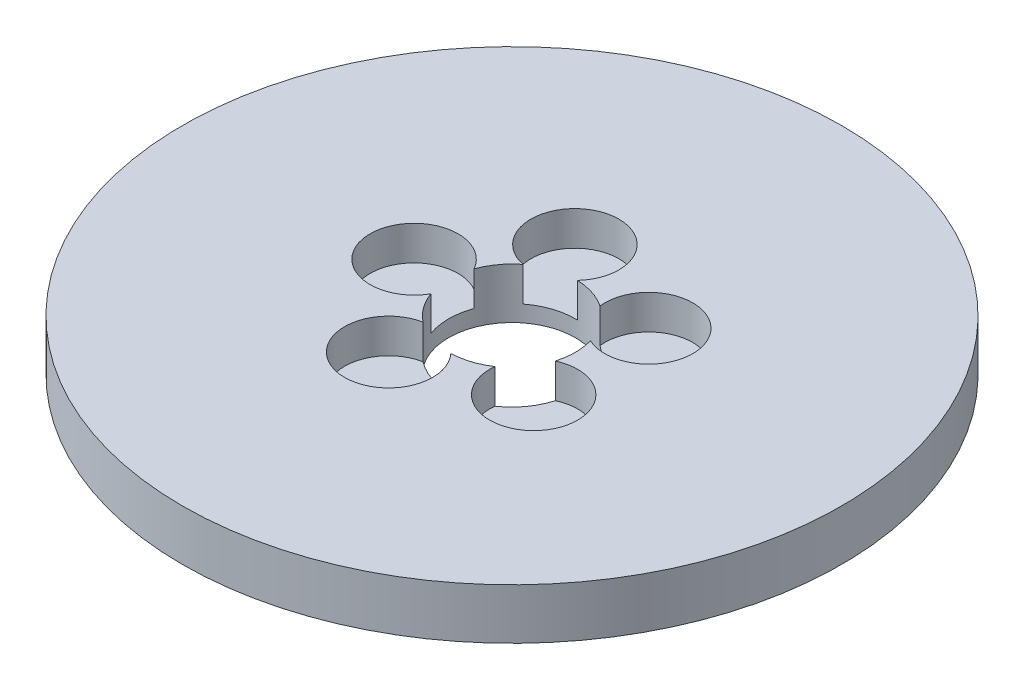
ISO-10303-21;
HEADER;
FILE_DESCRIPTION(('STEP AP214'),'2;1');
FILE_NAME('part.step','',(''),(''),'','','');
FILE_SCHEMA(('AUTOMOTIVE_DESIGN { 1 0 10303 214 1 1 1 1 }'));
ENDSEC;
DATA;
#1=APPLICATION_CONTEXT('core data for automotive mechanical design processes');
#2=APPLICATION_PROTOCOL_DEFINITION('international standard','automotive_design',2000,#1);
#3=PRODUCT_CONTEXT('',#1,'mechanical');
#4=PRODUCT('Part','Part','',(#3));
#5=PRODUCT_RELATED_PRODUCT_CATEGORY('part','',(#4));
#6=PRODUCT_DEFINITION_FORMATION('','',#4);
#7=PRODUCT_DEFINITION_CONTEXT('part definition',#1,'design');
#8=PRODUCT_DEFINITION('design','',#6,#7);
#9=PRODUCT_DEFINITION_SHAPE('','',#8);
#10=(LENGTH_UNIT() NAMED_UNIT(*) SI_UNIT(.MILLI.,.METRE.));
#11=(NAMED_UNIT(*) PLANE_ANGLE_UNIT() SI_UNIT($,.RADIAN.));
#12=(NAMED_UNIT(*) SI_UNIT($,.STERADIAN.) SOLID_ANGLE_UNIT());
#13=UNCERTAINTY_MEASURE_WITH_UNIT(LENGTH_MEASURE(1.E-05),#10,'distance_accuracy_value','');
#14=(GEOMETRIC_REPRESENTATION_CONTEXT(3) GLOBAL_UNCERTAINTY_ASSIGNED_CONTEXT((#13)) GLOBAL_UNIT_ASSIGNED_CONTEXT((#10,
#11,#12)) REPRESENTATION_CONTEXT('',''));
#15=CARTESIAN_POINT('',(0.,0.,0.));
#16=DIRECTION('',(0.,0.,1.));
#17=DIRECTION('',(1.,0.,0.));
#18=AXIS2_PLACEMENT_3D('',#15,#16,#17);
#19=CARTESIAN_POINT('',(0.,10.,0.));
#20=DIRECTION('',(0.,-1.,0.));
#21=DIRECTION('',(0.,0.,-1.));
#22=AXIS2_PLACEMENT_3D('',#19,#20,#21);
#23=CYLINDRICAL_SURFACE('',#22,65.);
#24=CARTESIAN_POINT('',(0.,10.,0.));
#25=DIRECTION('',(0.,1.,0.));
#26=DIRECTION('',(0.,0.,1.));
#27=AXIS2_PLACEMENT_3D('',#24,#25,#26);
#28=CIRCLE('',#27,65.);
#29=CARTESIAN_POINT('',(0.,10.,65.));
#30=VERTEX_POINT('',#29);
#31=EDGE_CURVE('E157',#30,#30,#28,.T.);
#32=ORIENTED_EDGE('',*,*,#31,.F.);
#33=EDGE_LOOP('',(#32));
#34=FACE_BOUND('',#33,.T.);
#35=CARTESIAN_POINT('',(0.,0.,0.));
#36=DIRECTION('',(0.,1.,0.));
#37=DIRECTION('',(0.,0.,1.));
#38=AXIS2_PLACEMENT_3D('',#35,#36,#37);
#39=CIRCLE('',#38,65.);
#40=CARTESIAN_POINT('',(0.,0.,65.));
#41=VERTEX_POINT('',#40);
#42=EDGE_CURVE('E150',#41,#41,#39,.T.);
#43=ORIENTED_EDGE('',*,*,#42,.T.);
#44=EDGE_LOOP('',(#43));
#45=FACE_BOUND('',#44,.T.);
#46=ADVANCED_FACE('F39',(#34,#45),#23,.T.);
#47=CARTESIAN_POINT('',(0.,10.,0.));
#48=DIRECTION('',(0.,1.,0.));
#49=DIRECTION('',(0.,0.,1.));
#50=AXIS2_PLACEMENT_3D('',#47,#48,#49);
#51=PLANE('',#50);
#52=CARTESIAN_POINT('',(-5.96773820092285,10.,-18.3668096151514));
#53=DIRECTION('',(0.,1.,0.));
#54=DIRECTION('',(-0.95105651629515,0.,0.309016994374958));
#55=AXIS2_PLACEMENT_3D('',#52,#53,#54);
#56=CIRCLE('',#55,8.68334895142831);
#57=CARTESIAN_POINT('',(0.427209526184432,10.,-12.4926975477972));
#58=VERTEX_POINT('',#57);
#59=CARTESIAN_POINT('',(-7.68864314678781,10.,-9.8556971626239));
#60=VERTEX_POINT('',#59);
#61=EDGE_CURVE('E194',#58,#60,#56,.T.);
#62=ORIENTED_EDGE('',*,*,#61,.F.);
#63=CARTESIAN_POINT('',(0.,10.,0.));
#64=DIRECTION('',(0.,1.,0.));
#65=DIRECTION('',(0.,0.,1.));
#66=AXIS2_PLACEMENT_3D('',#63,#64,#65);
#67=CIRCLE('',#66,12.5);
#68=CARTESIAN_POINT('',(6.99740361310323,10.,-10.3579120808843));
#69=VERTEX_POINT('',#68);
#70=EDGE_CURVE('E147',#69,#58,#67,.T.);
#71=ORIENTED_EDGE('',*,*,#70,.F.);
#72=CARTESIAN_POINT('',(15.6237414459765,10.,-11.3513126070621));
#73=DIRECTION('',(0.,1.,0.));
#74=DIRECTION('',(-0.58778525229248,0.,-0.809016994374942));
#75=AXIS2_PLACEMENT_3D('',#72,#73,#74);
#76=CIRCLE('',#75,8.68334895142831);
#77=CARTESIAN_POINT('',(12.0132764126868,10.,-3.45415544415446));
#78=VERTEX_POINT('',#77);
#79=EDGE_CURVE('E254',#78,#69,#76,.T.);
#80=ORIENTED_EDGE('',*,*,#79,.F.);
#81=CARTESIAN_POINT('',(12.0132764126869,10.,3.45415544415428));
#82=VERTEX_POINT('',#81);
#83=EDGE_CURVE('E144',#82,#78,#67,.T.);
#84=ORIENTED_EDGE('',*,*,#83,.F.);
#85=CARTESIAN_POINT('',(15.6237414459767,10.,11.3513126070619));
#86=DIRECTION('',(0.,1.,0.));
#87=DIRECTION('',(0.587785252292469,0.,-0.809016994374951));
#88=AXIS2_PLACEMENT_3D('',#85,#86,#87);
#89=CIRCLE('',#88,8.68334895142831);
#90=CARTESIAN_POINT('',(6.99740361310339,10.,10.3579120808842));
#91=VERTEX_POINT('',#90);
#92=EDGE_CURVE('E141',#91,#82,#89,.T.);
#93=ORIENTED_EDGE('',*,*,#92,.F.);
#94=CARTESIAN_POINT('',(0.427209526184603,10.,12.4926975477972));
#95=VERTEX_POINT('',#94);
#96=EDGE_CURVE('E134',#95,#91,#67,.T.);
#97=ORIENTED_EDGE('',*,*,#96,.F.);
#98=CARTESIAN_POINT('',(-5.96773820092259,10.,18.3668096151515));
#99=DIRECTION('',(0.,1.,0.));
#100=DIRECTION('',(0.951056516295155,0.,0.309016994374945));
#101=AXIS2_PLACEMENT_3D('',#98,#99,#100);
#102=CIRCLE('',#101,8.68334895142831);
#103=CARTESIAN_POINT('',(-7.68864314678767,10.,9.85569716262401));
#104=VERTEX_POINT('',#103);
#105=EDGE_CURVE('E111',#104,#95,#102,.T.);
#106=ORIENTED_EDGE('',*,*,#105,.F.);
#107=CARTESIAN_POINT('',(-11.7492464051871,10.,4.26675625155676));
#108=VERTEX_POINT('',#107);
#109=EDGE_CURVE('E145',#108,#104,#67,.T.);
#110=ORIENTED_EDGE('',*,*,#109,.F.);
#111=CARTESIAN_POINT('',(-19.312006490108,10.,0.));
#112=DIRECTION('',(0.,1.,0.));
#113=DIRECTION('',(0.,0.,1.));
#114=AXIS2_PLACEMENT_3D('',#111,#112,#113);
#115=CIRCLE('',#114,8.68334895142831);
#116=CARTESIAN_POINT('',(-11.7492464051871,10.,-4.26675625155676));
#117=VERTEX_POINT('',#116);
#118=EDGE_CURVE('E153',#117,#108,#115,.T.);
#119=ORIENTED_EDGE('',*,*,#118,.F.);
#120=EDGE_CURVE('E146',#60,#117,#67,.T.);
#121=ORIENTED_EDGE('',*,*,#120,.F.);
#122=EDGE_LOOP('',(#62,#71,#80,#84,#93,#97,#106,#110,#119,#121));
#123=FACE_BOUND('',#122,.T.);
#124=ORIENTED_EDGE('',*,*,#31,.T.);
#125=EDGE_LOOP('',(#124));
#126=FACE_BOUND('',#125,.T.);
#127=ADVANCED_FACE('F139',(#123,#126),#51,.T.);
#128=CARTESIAN_POINT('',(0.,0.,0.));
#129=DIRECTION('',(0.,1.,0.));
#130=DIRECTION('',(0.,0.,1.));
#131=AXIS2_PLACEMENT_3D('',#128,#129,#130);
#132=PLANE('',#131);
#133=CARTESIAN_POINT('',(0.,0.,0.));
#134=DIRECTION('',(0.,1.,0.));
#135=DIRECTION('',(0.,0.,1.));
#136=AXIS2_PLACEMENT_3D('',#133,#134,#135);
#137=CIRCLE('',#136,12.5);
#138=CARTESIAN_POINT('',(0.,0.,12.5));
#139=VERTEX_POINT('',#138);
#140=EDGE_CURVE('E154',#139,#139,#137,.T.);
#141=ORIENTED_EDGE('',*,*,#140,.T.);
#142=EDGE_LOOP('',(#141));
#143=FACE_BOUND('',#142,.T.);
#144=ORIENTED_EDGE('',*,*,#42,.F.);
#145=EDGE_LOOP('',(#144));
#146=FACE_BOUND('',#145,.T.);
#147=ADVANCED_FACE('F213',(#143,#146),#132,.F.);
#148=CARTESIAN_POINT('',(0.,10.,0.));
#149=DIRECTION('',(0.,-1.,0.));
#150=DIRECTION('',(0.,0.,-1.));
#151=AXIS2_PLACEMENT_3D('',#148,#149,#150);
#152=CYLINDRICAL_SURFACE('',#151,12.5);
#153=DIRECTION('',(0.,1.,0.));
#154=VECTOR('',#153,1.);
#155=CARTESIAN_POINT('',(0.427209526184431,6.61251886122305,-12.4926975477972));
#156=LINE('',#155,#154);
#157=CARTESIAN_POINT('',(0.427209526184432,3.22503772244611,-12.4926975477972));
#158=VERTEX_POINT('',#157);
#159=EDGE_CURVE('E11',#158,#58,#156,.T.);
#160=ORIENTED_EDGE('',*,*,#159,.F.);
#161=CARTESIAN_POINT('',(0.,3.22503772244611,0.));
#162=DIRECTION('',(0.,1.,0.));
#163=DIRECTION('',(0.,0.,1.));
#164=AXIS2_PLACEMENT_3D('',#161,#162,#163);
#165=CIRCLE('',#164,12.5);
#166=CARTESIAN_POINT('',(-7.68864314678781,3.22503772244611,-9.8556971626239));
#167=VERTEX_POINT('',#166);
#168=EDGE_CURVE('E189',#158,#167,#165,.T.);
#169=ORIENTED_EDGE('',*,*,#168,.T.);
#170=DIRECTION('',(0.,1.,0.));
#171=VECTOR('',#170,1.);
#172=CARTESIAN_POINT('',(-7.68864314678782,6.61251886122305,-9.8556971626239));
#173=LINE('',#172,#171);
#174=EDGE_CURVE('E46',#60,#167,#173,.F.);
#175=ORIENTED_EDGE('',*,*,#174,.F.);
#176=ORIENTED_EDGE('',*,*,#120,.T.);
#177=DIRECTION('',(0.,1.,0.));
#178=VECTOR('',#177,1.);
#179=CARTESIAN_POINT('',(-11.7492464051871,6.61251886122305,-4.26675625155676));
#180=LINE('',#179,#178);
#181=CARTESIAN_POINT('',(-11.7492464051871,3.22503772244611,-4.26675625155676));
#182=VERTEX_POINT('',#181);
#183=EDGE_CURVE('E168',#182,#117,#180,.T.);
#184=ORIENTED_EDGE('',*,*,#183,.F.);
#185=CARTESIAN_POINT('',(0.,3.22503772244611,0.));
#186=DIRECTION('',(0.,1.,0.));
#187=DIRECTION('',(0.,0.,1.));
#188=AXIS2_PLACEMENT_3D('',#185,#186,#187);
#189=CIRCLE('',#188,12.5);
#190=CARTESIAN_POINT('',(-11.7492464051871,3.22503772244611,4.26675625155676));
#191=VERTEX_POINT('',#190);
#192=EDGE_CURVE('E165',#182,#191,#189,.T.);
#193=ORIENTED_EDGE('',*,*,#192,.T.);
#194=DIRECTION('',(0.,1.,0.));
#195=VECTOR('',#194,1.);
#196=CARTESIAN_POINT('',(-11.7492464051871,6.61251886122305,4.26675625155676));
#197=LINE('',#196,#195);
#198=EDGE_CURVE('E170',#108,#191,#197,.F.);
#199=ORIENTED_EDGE('',*,*,#198,.F.);
#200=ORIENTED_EDGE('',*,*,#109,.T.);
#201=DIRECTION('',(0.,1.,0.));
#202=VECTOR('',#201,1.);
#203=CARTESIAN_POINT('',(-7.68864314678767,6.61251886122305,9.85569716262401));
#204=LINE('',#203,#202);
#205=CARTESIAN_POINT('',(-7.68864314678767,3.22503772244611,9.85569716262401));
#206=VERTEX_POINT('',#205);
#207=EDGE_CURVE('E121',#206,#104,#204,.T.);
#208=ORIENTED_EDGE('',*,*,#207,.F.);
#209=CARTESIAN_POINT('',(0.,3.22503772244611,0.));
#210=DIRECTION('',(0.,1.,0.));
#211=DIRECTION('',(0.,0.,1.));
#212=AXIS2_PLACEMENT_3D('',#209,#210,#211);
#213=CIRCLE('',#212,12.5);
#214=CARTESIAN_POINT('',(0.427209526184603,3.22503772244611,12.4926975477972));
#215=VERTEX_POINT('',#214);
#216=EDGE_CURVE('E136',#206,#215,#213,.T.);
#217=ORIENTED_EDGE('',*,*,#216,.T.);
#218=DIRECTION('',(0.,1.,0.));
#219=VECTOR('',#218,1.);
#220=CARTESIAN_POINT('',(0.427209526184603,6.61251886122305,12.4926975477972));
#221=LINE('',#220,#219);
#222=EDGE_CURVE('E117',#95,#215,#221,.F.);
#223=ORIENTED_EDGE('',*,*,#222,.F.);
#224=ORIENTED_EDGE('',*,*,#96,.T.);
#225=DIRECTION('',(0.,1.,0.));
#226=VECTOR('',#225,1.);
#227=CARTESIAN_POINT('',(6.99740361310339,6.61251886122305,10.3579120808842));
#228=LINE('',#227,#226);
#229=CARTESIAN_POINT('',(6.99740361310339,3.22503772244611,10.3579120808842));
#230=VERTEX_POINT('',#229);
#231=EDGE_CURVE('E182',#230,#91,#228,.T.);
#232=ORIENTED_EDGE('',*,*,#231,.F.);
#233=CARTESIAN_POINT('',(0.,3.22503772244611,0.));
#234=DIRECTION('',(0.,1.,0.));
#235=DIRECTION('',(0.,0.,1.));
#236=AXIS2_PLACEMENT_3D('',#233,#234,#235);
#237=CIRCLE('',#236,12.5);
#238=CARTESIAN_POINT('',(12.0132764126869,3.22503772244611,3.45415544415428));
#239=VERTEX_POINT('',#238);
#240=EDGE_CURVE('E174',#230,#239,#237,.T.);
#241=ORIENTED_EDGE('',*,*,#240,.T.);
#242=DIRECTION('',(0.,1.,0.));
#243=VECTOR('',#242,1.);
#244=CARTESIAN_POINT('',(12.0132764126869,6.61251886122305,3.45415544415428));
#245=LINE('',#244,#243);
#246=EDGE_CURVE('E177',#82,#239,#245,.F.);
#247=ORIENTED_EDGE('',*,*,#246,.F.);
#248=ORIENTED_EDGE('',*,*,#83,.T.);
#249=DIRECTION('',(0.,1.,0.));
#250=VECTOR('',#249,1.);
#251=CARTESIAN_POINT('',(12.0132764126868,6.61251886122305,-3.45415544415446));
#252=LINE('',#251,#250);
#253=CARTESIAN_POINT('',(12.0132764126868,3.22503772244611,-3.45415544415446));
#254=VERTEX_POINT('',#253);
#255=EDGE_CURVE('E187',#254,#78,#252,.T.);
#256=ORIENTED_EDGE('',*,*,#255,.F.);
#257=CARTESIAN_POINT('',(0.,3.22503772244611,0.));
#258=DIRECTION('',(0.,1.,0.));
#259=DIRECTION('',(0.,0.,1.));
#260=AXIS2_PLACEMENT_3D('',#257,#258,#259);
#261=CIRCLE('',#260,12.5);
#262=CARTESIAN_POINT('',(6.99740361310323,3.22503772244611,-10.3579120808843));
#263=VERTEX_POINT('',#262);
#264=EDGE_CURVE('E181',#254,#263,#261,.T.);
#265=ORIENTED_EDGE('',*,*,#264,.T.);
#266=DIRECTION('',(0.,1.,0.));
#267=VECTOR('',#266,1.);
#268=CARTESIAN_POINT('',(6.99740361310323,6.61251886122305,-10.3579120808843));
#269=LINE('',#268,#267);
#270=EDGE_CURVE('E186',#69,#263,#269,.F.);
#271=ORIENTED_EDGE('',*,*,#270,.F.);
#272=ORIENTED_EDGE('',*,*,#70,.T.);
#273=EDGE_LOOP('',(#160,#169,#175,#176,#184,#193,#199,#200,#208,#217,#223,#224,#232,#241,#247,
#248,#256,#265,#271,#272));
#274=FACE_BOUND('',#273,.T.);
#275=ORIENTED_EDGE('',*,*,#140,.F.);
#276=EDGE_LOOP('',(#275));
#277=FACE_BOUND('',#276,.T.);
#278=ADVANCED_FACE('F135',(#274,#277),#152,.F.);
#279=CARTESIAN_POINT('',(-19.312006490108,3.22503772244611,0.));
#280=DIRECTION('',(0.,1.,0.));
#281=DIRECTION('',(0.,0.,1.));
#282=AXIS2_PLACEMENT_3D('',#279,#280,#281);
#283=CYLINDRICAL_SURFACE('',#282,8.68334895142831);
#284=ORIENTED_EDGE('',*,*,#183,.T.);
#285=ORIENTED_EDGE('',*,*,#118,.T.);
#286=ORIENTED_EDGE('',*,*,#198,.T.);
#287=CARTESIAN_POINT('',(-19.312006490108,3.22503772244611,0.));
#288=DIRECTION('',(0.,1.,0.));
#289=DIRECTION('',(0.,0.,1.));
#290=AXIS2_PLACEMENT_3D('',#287,#288,#289);
#291=CIRCLE('',#290,8.68334895142831);
#292=EDGE_CURVE('E158',#182,#191,#291,.T.);
#293=ORIENTED_EDGE('',*,*,#292,.F.);
#294=EDGE_LOOP('',(#284,#285,#286,#293));
#295=FACE_BOUND('',#294,.T.);
#296=ADVANCED_FACE('F221',(#295),#283,.F.);
#297=CARTESIAN_POINT('',(-19.312006490108,3.22503772244611,0.));
#298=DIRECTION('',(0.,1.,0.));
#299=DIRECTION('',(0.,0.,1.));
#300=AXIS2_PLACEMENT_3D('',#297,#298,#299);
#301=PLANE('',#300);
#302=ORIENTED_EDGE('',*,*,#292,.T.);
#303=ORIENTED_EDGE('',*,*,#192,.F.);
#304=EDGE_LOOP('',(#302,#303));
#305=FACE_BOUND('',#304,.T.);
#306=ADVANCED_FACE('F227',(#305),#301,.T.);
#307=CARTESIAN_POINT('',(-5.96773820092259,3.22503772244611,18.3668096151515));
#308=DIRECTION('',(0.,1.,0.));
#309=DIRECTION('',(0.,0.,1.));
#310=AXIS2_PLACEMENT_3D('',#307,#308,#309);
#311=CYLINDRICAL_SURFACE('',#310,8.68334895142831);
#312=ORIENTED_EDGE('',*,*,#207,.T.);
#313=ORIENTED_EDGE('',*,*,#105,.T.);
#314=ORIENTED_EDGE('',*,*,#222,.T.);
#315=CARTESIAN_POINT('',(-5.96773820092259,3.22503772244611,18.3668096151515));
#316=DIRECTION('',(0.,1.,0.));
#317=DIRECTION('',(0.951056516295155,0.,0.309016994374945));
#318=AXIS2_PLACEMENT_3D('',#315,#316,#317);
#319=CIRCLE('',#318,8.68334895142831);
#320=EDGE_CURVE('E127',#206,#215,#319,.T.);
#321=ORIENTED_EDGE('',*,*,#320,.F.);
#322=EDGE_LOOP('',(#312,#313,#314,#321));
#323=FACE_BOUND('',#322,.T.);
#324=ADVANCED_FACE('F116',(#323),#311,.F.);
#325=CARTESIAN_POINT('',(-5.96773820092259,3.22503772244611,18.3668096151515));
#326=DIRECTION('',(0.,1.,0.));
#327=DIRECTION('',(0.951056516295155,0.,0.309016994374945));
#328=AXIS2_PLACEMENT_3D('',#325,#326,#327);
#329=PLANE('',#328);
#330=ORIENTED_EDGE('',*,*,#320,.T.);
#331=ORIENTED_EDGE('',*,*,#216,.F.);
#332=EDGE_LOOP('',(#330,#331));
#333=FACE_BOUND('',#332,.T.);
#334=ADVANCED_FACE('F234',(#333),#329,.T.);
#335=CARTESIAN_POINT('',(15.6237414459767,3.22503772244611,11.3513126070619));
#336=DIRECTION('',(0.,1.,0.));
#337=DIRECTION('',(0.,0.,1.));
#338=AXIS2_PLACEMENT_3D('',#335,#336,#337);
#339=CYLINDRICAL_SURFACE('',#338,8.68334895142831);
#340=ORIENTED_EDGE('',*,*,#231,.T.);
#341=ORIENTED_EDGE('',*,*,#92,.T.);
#342=ORIENTED_EDGE('',*,*,#246,.T.);
#343=CARTESIAN_POINT('',(15.6237414459767,3.22503772244611,11.3513126070619));
#344=DIRECTION('',(0.,1.,0.));
#345=DIRECTION('',(0.587785252292469,0.,-0.809016994374951));
#346=AXIS2_PLACEMENT_3D('',#343,#344,#345);
#347=CIRCLE('',#346,8.68334895142831);
#348=EDGE_CURVE('E130',#230,#239,#347,.T.);
#349=ORIENTED_EDGE('',*,*,#348,.F.);
#350=EDGE_LOOP('',(#340,#341,#342,#349));
#351=FACE_BOUND('',#350,.T.);
#352=ADVANCED_FACE('F240',(#351),#339,.F.);
#353=CARTESIAN_POINT('',(15.6237414459767,3.22503772244611,11.3513126070619));
#354=DIRECTION('',(0.,1.,0.));
#355=DIRECTION('',(0.587785252292469,0.,-0.809016994374951));
#356=AXIS2_PLACEMENT_3D('',#353,#354,#355);
#357=PLANE('',#356);
#358=ORIENTED_EDGE('',*,*,#348,.T.);
#359=ORIENTED_EDGE('',*,*,#240,.F.);
#360=EDGE_LOOP('',(#358,#359));
#361=FACE_BOUND('',#360,.T.);
#362=ADVANCED_FACE('F245',(#361),#357,.T.);
#363=CARTESIAN_POINT('',(15.6237414459765,3.22503772244611,-11.3513126070621));
#364=DIRECTION('',(0.,1.,0.));
#365=DIRECTION('',(0.,0.,1.));
#366=AXIS2_PLACEMENT_3D('',#363,#364,#365);
#367=CYLINDRICAL_SURFACE('',#366,8.68334895142831);
#368=ORIENTED_EDGE('',*,*,#255,.T.);
#369=ORIENTED_EDGE('',*,*,#79,.T.);
#370=ORIENTED_EDGE('',*,*,#270,.T.);
#371=CARTESIAN_POINT('',(15.6237414459765,3.22503772244611,-11.3513126070621));
#372=DIRECTION('',(0.,1.,0.));
#373=DIRECTION('',(-0.58778525229248,0.,-0.809016994374942));
#374=AXIS2_PLACEMENT_3D('',#371,#372,#373);
#375=CIRCLE('',#374,8.68334895142831);
#376=EDGE_CURVE('E56',#254,#263,#375,.T.);
#377=ORIENTED_EDGE('',*,*,#376,.F.);
#378=EDGE_LOOP('',(#368,#369,#370,#377));
#379=FACE_BOUND('',#378,.T.);
#380=ADVANCED_FACE('F266',(#379),#367,.F.);
#381=CARTESIAN_POINT('',(15.6237414459765,3.22503772244611,-11.3513126070621));
#382=DIRECTION('',(0.,1.,0.));
#383=DIRECTION('',(-0.58778525229248,0.,-0.809016994374942));
#384=AXIS2_PLACEMENT_3D('',#381,#382,#383);
#385=PLANE('',#384);
#386=ORIENTED_EDGE('',*,*,#376,.T.);
#387=ORIENTED_EDGE('',*,*,#264,.F.);
#388=EDGE_LOOP('',(#386,#387));
#389=FACE_BOUND('',#388,.T.);
#390=ADVANCED_FACE('F204',(#389),#385,.T.);
#391=CARTESIAN_POINT('',(-5.96773820092285,3.22503772244611,-18.3668096151514));
#392=DIRECTION('',(0.,1.,0.));
#393=DIRECTION('',(0.,0.,1.));
#394=AXIS2_PLACEMENT_3D('',#391,#392,#393);
#395=CYLINDRICAL_SURFACE('',#394,8.68334895142831);
#396=ORIENTED_EDGE('',*,*,#159,.T.);
#397=ORIENTED_EDGE('',*,*,#61,.T.);
#398=ORIENTED_EDGE('',*,*,#174,.T.);
#399=CARTESIAN_POINT('',(-5.96773820092285,3.22503772244611,-18.3668096151514));
#400=DIRECTION('',(0.,1.,0.));
#401=DIRECTION('',(-0.95105651629515,0.,0.309016994374958));
#402=AXIS2_PLACEMENT_3D('',#399,#400,#401);
#403=CIRCLE('',#402,8.68334895142831);
#404=EDGE_CURVE('E55',#158,#167,#403,.T.);
#405=ORIENTED_EDGE('',*,*,#404,.F.);
#406=EDGE_LOOP('',(#396,#397,#398,#405));
#407=FACE_BOUND('',#406,.T.);
#408=ADVANCED_FACE('F193',(#407),#395,.F.);
#409=CARTESIAN_POINT('',(-5.96773820092285,3.22503772244611,-18.3668096151514));
#410=DIRECTION('',(0.,1.,0.));
#411=DIRECTION('',(-0.95105651629515,0.,0.309016994374958));
#412=AXIS2_PLACEMENT_3D('',#409,#410,#411);
#413=PLANE('',#412);
#414=ORIENTED_EDGE('',*,*,#404,.T.);
#415=ORIENTED_EDGE('',*,*,#168,.F.);
#416=EDGE_LOOP('',(#414,#415));
#417=FACE_BOUND('',#416,.T.);
#418=ADVANCED_FACE('F196',(#417),#413,.T.);
#419=CLOSED_SHELL('',(#46,#127,#147,#278,#296,#306,#324,#334,#352,#362,#380,#390,#408,#418));
#420=MANIFOLD_SOLID_BREP('B2',#419);
#421=ADVANCED_BREP_SHAPE_REPRESENTATION('',(#18,#420),#14);
#422=SHAPE_DEFINITION_REPRESENTATION(#9,#421);
ENDSEC;
END-ISO-10303-21;
